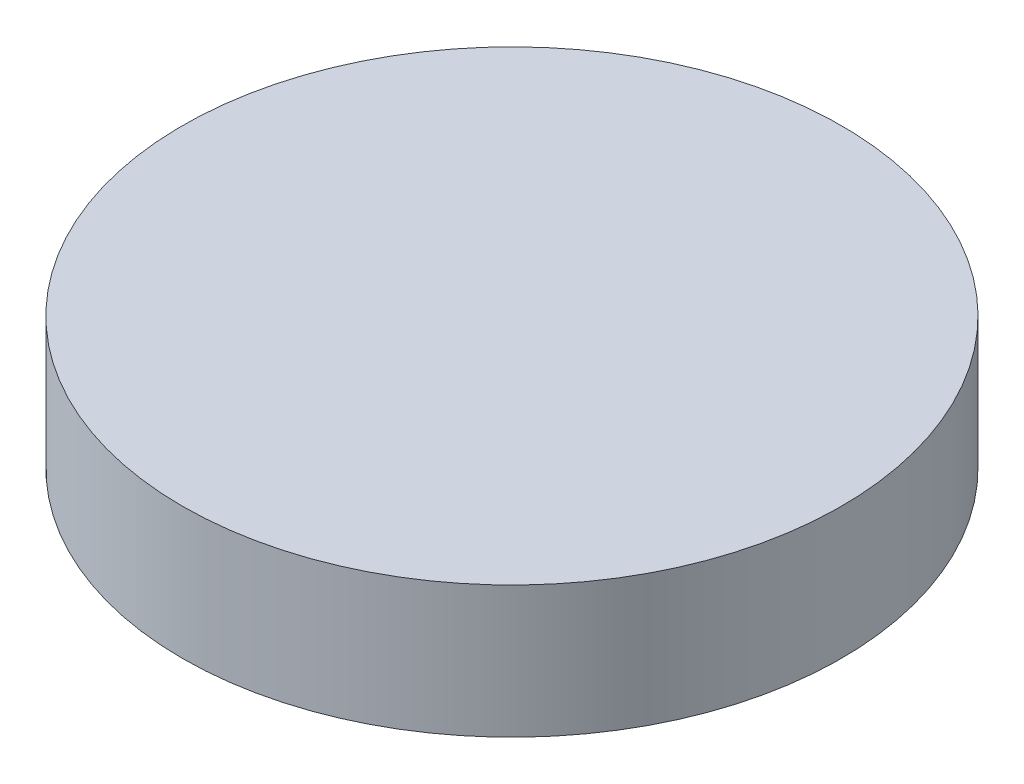
ISO-10303-21;
HEADER;
FILE_DESCRIPTION(('STEP AP214'),'2;1');
FILE_NAME('part.step','',(''),(''),'','','');
FILE_SCHEMA(('AUTOMOTIVE_DESIGN { 1 0 10303 214 1 1 1 1 }'));
ENDSEC;
DATA;
#1=APPLICATION_CONTEXT('core data for automotive mechanical design processes');
#2=APPLICATION_PROTOCOL_DEFINITION('international standard','automotive_design',2000,#1);
#3=PRODUCT_CONTEXT('',#1,'mechanical');
#4=PRODUCT('Part','Part','',(#3));
#5=PRODUCT_RELATED_PRODUCT_CATEGORY('part','',(#4));
#6=PRODUCT_DEFINITION_FORMATION('','',#4);
#7=PRODUCT_DEFINITION_CONTEXT('part definition',#1,'design');
#8=PRODUCT_DEFINITION('design','',#6,#7);
#9=PRODUCT_DEFINITION_SHAPE('','',#8);
#10=(LENGTH_UNIT() NAMED_UNIT(*) SI_UNIT(.MILLI.,.METRE.));
#11=(NAMED_UNIT(*) PLANE_ANGLE_UNIT() SI_UNIT($,.RADIAN.));
#12=(NAMED_UNIT(*) SI_UNIT($,.STERADIAN.) SOLID_ANGLE_UNIT());
#13=UNCERTAINTY_MEASURE_WITH_UNIT(LENGTH_MEASURE(1.E-05),#10,'distance_accuracy_value','');
#14=(GEOMETRIC_REPRESENTATION_CONTEXT(3) GLOBAL_UNCERTAINTY_ASSIGNED_CONTEXT((#13)) GLOBAL_UNIT_ASSIGNED_CONTEXT((#10,
#11,#12)) REPRESENTATION_CONTEXT('',''));
#15=CARTESIAN_POINT('',(0.,0.,0.));
#16=DIRECTION('',(0.,0.,1.));
#17=DIRECTION('',(1.,0.,0.));
#18=AXIS2_PLACEMENT_3D('',#15,#16,#17);
#19=CARTESIAN_POINT('',(0.,2.54,0.));
#20=DIRECTION('',(0.,-1.,0.));
#21=DIRECTION('',(0.,0.,-1.));
#22=AXIS2_PLACEMENT_3D('',#19,#20,#21);
#23=CYLINDRICAL_SURFACE('',#22,6.35);
#24=CARTESIAN_POINT('',(0.,2.54,0.));
#25=DIRECTION('',(0.,1.,0.));
#26=DIRECTION('',(0.,0.,1.));
#27=AXIS2_PLACEMENT_3D('',#24,#25,#26);
#28=CIRCLE('',#27,6.35);
#29=CARTESIAN_POINT('',(0.,2.54,6.35));
#30=VERTEX_POINT('',#29);
#31=EDGE_CURVE('E10',#30,#30,#28,.T.);
#32=ORIENTED_EDGE('',*,*,#31,.F.);
#33=EDGE_LOOP('',(#32));
#34=FACE_BOUND('',#33,.T.);
#35=CARTESIAN_POINT('',(0.,0.,0.));
#36=DIRECTION('',(0.,1.,0.));
#37=DIRECTION('',(0.,0.,1.));
#38=AXIS2_PLACEMENT_3D('',#35,#36,#37);
#39=CIRCLE('',#38,6.35);
#40=CARTESIAN_POINT('',(0.,0.,6.35));
#41=VERTEX_POINT('',#40);
#42=EDGE_CURVE('E35',#41,#41,#39,.T.);
#43=ORIENTED_EDGE('',*,*,#42,.T.);
#44=EDGE_LOOP('',(#43));
#45=FACE_BOUND('',#44,.T.);
#46=ADVANCED_FACE('F32',(#34,#45),#23,.T.);
#47=CARTESIAN_POINT('',(0.,2.54,0.));
#48=DIRECTION('',(0.,1.,0.));
#49=DIRECTION('',(0.,0.,1.));
#50=AXIS2_PLACEMENT_3D('',#47,#48,#49);
#51=PLANE('',#50);
#52=ORIENTED_EDGE('',*,*,#31,.T.);
#53=EDGE_LOOP('',(#52));
#54=FACE_BOUND('',#53,.T.);
#55=ADVANCED_FACE('F47',(#54),#51,.T.);
#56=CARTESIAN_POINT('',(0.,0.,0.));
#57=DIRECTION('',(0.,1.,0.));
#58=DIRECTION('',(0.,0.,1.));
#59=AXIS2_PLACEMENT_3D('',#56,#57,#58);
#60=PLANE('',#59);
#61=ORIENTED_EDGE('',*,*,#42,.F.);
#62=EDGE_LOOP('',(#61));
#63=FACE_BOUND('',#62,.T.);
#64=ADVANCED_FACE('F45',(#63),#60,.F.);
#65=CLOSED_SHELL('',(#46,#55,#64));
#66=MANIFOLD_SOLID_BREP('B2',#65);
#67=ADVANCED_BREP_SHAPE_REPRESENTATION('',(#18,#66),#14);
#68=SHAPE_DEFINITION_REPRESENTATION(#9,#67);
ENDSEC;
END-ISO-10303-21;
